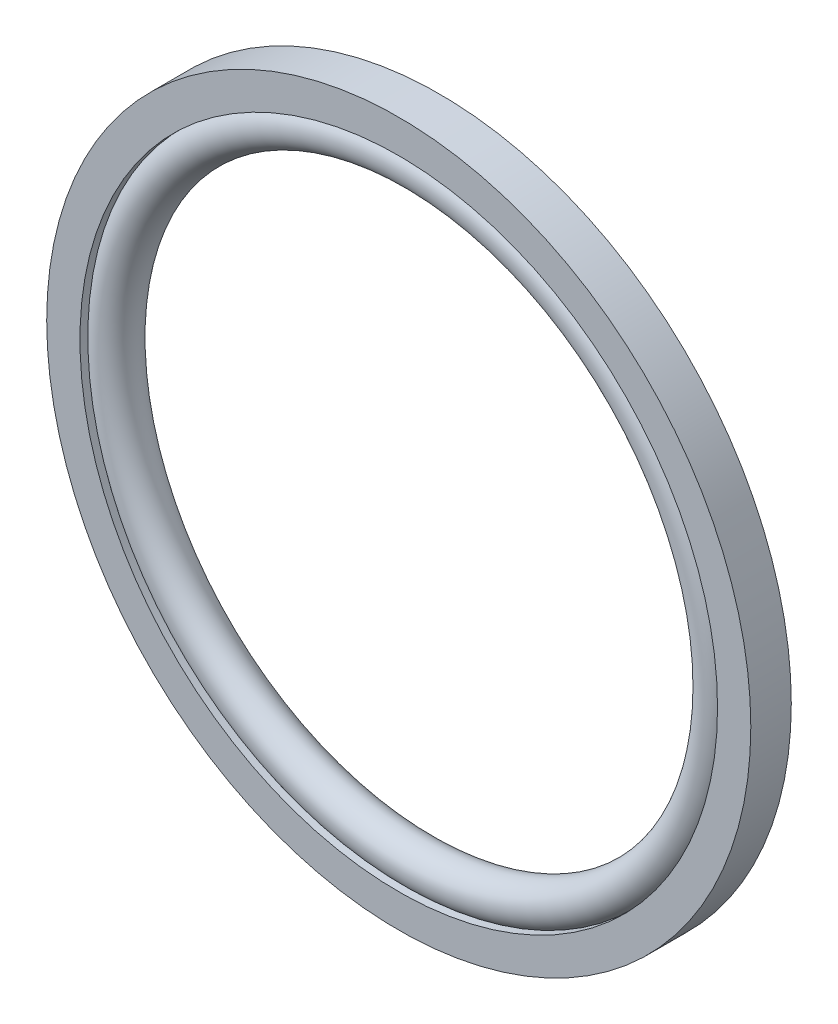
ISO-10303-21;
HEADER;
FILE_DESCRIPTION(('STEP AP214'),'2;1');
FILE_NAME('part.step','',(''),(''),'','','');
FILE_SCHEMA(('AUTOMOTIVE_DESIGN { 1 0 10303 214 1 1 1 1 }'));
ENDSEC;
DATA;
#1=APPLICATION_CONTEXT('core data for automotive mechanical design processes');
#2=APPLICATION_PROTOCOL_DEFINITION('international standard','automotive_design',2000,#1);
#3=PRODUCT_CONTEXT('',#1,'mechanical');
#4=PRODUCT('Part','Part','',(#3));
#5=PRODUCT_RELATED_PRODUCT_CATEGORY('part','',(#4));
#6=PRODUCT_DEFINITION_FORMATION('','',#4);
#7=PRODUCT_DEFINITION_CONTEXT('part definition',#1,'design');
#8=PRODUCT_DEFINITION('design','',#6,#7);
#9=PRODUCT_DEFINITION_SHAPE('','',#8);
#10=(LENGTH_UNIT() NAMED_UNIT(*) SI_UNIT(.MILLI.,.METRE.));
#11=(NAMED_UNIT(*) PLANE_ANGLE_UNIT() SI_UNIT($,.RADIAN.));
#12=(NAMED_UNIT(*) SI_UNIT($,.STERADIAN.) SOLID_ANGLE_UNIT());
#13=UNCERTAINTY_MEASURE_WITH_UNIT(LENGTH_MEASURE(1.E-05),#10,'distance_accuracy_value','');
#14=(GEOMETRIC_REPRESENTATION_CONTEXT(3) GLOBAL_UNCERTAINTY_ASSIGNED_CONTEXT((#13)) GLOBAL_UNIT_ASSIGNED_CONTEXT((#10,
#11,#12)) REPRESENTATION_CONTEXT('',''));
#15=CARTESIAN_POINT('',(0.,0.,0.));
#16=DIRECTION('',(0.,0.,1.));
#17=DIRECTION('',(1.,0.,0.));
#18=AXIS2_PLACEMENT_3D('',#15,#16,#17);
#19=CARTESIAN_POINT('',(0.,0.,0.));
#20=DIRECTION('',(0.,0.,1.));
#21=DIRECTION('',(1.,0.,0.));
#22=AXIS2_PLACEMENT_3D('',#19,#20,#21);
#23=TOROIDAL_SURFACE('',#22,21.8313,1.4605);
#24=CARTESIAN_POINT('',(0.,0.,-0.876299999999997));
#25=DIRECTION('',(0.,0.,1.));
#26=DIRECTION('',(1.,0.,0.));
#27=AXIS2_PLACEMENT_3D('',#24,#25,#26);
#28=CIRCLE('',#27,22.9997);
#29=CARTESIAN_POINT('',(22.9997,0.,-0.876299999999997));
#30=VERTEX_POINT('',#29);
#31=EDGE_CURVE('E11',#30,#30,#28,.T.);
#32=ORIENTED_EDGE('',*,*,#31,.F.);
#33=EDGE_LOOP('',(#32));
#34=FACE_BOUND('',#33,.T.);
#35=CARTESIAN_POINT('',(0.,0.,0.876299999999997));
#36=DIRECTION('',(0.,0.,1.));
#37=DIRECTION('',(1.,0.,0.));
#38=AXIS2_PLACEMENT_3D('',#35,#36,#37);
#39=CIRCLE('',#38,22.9997);
#40=CARTESIAN_POINT('',(22.9997,0.,0.876299999999997));
#41=VERTEX_POINT('',#40);
#42=EDGE_CURVE('E48',#41,#41,#39,.T.);
#43=ORIENTED_EDGE('',*,*,#42,.T.);
#44=EDGE_LOOP('',(#43));
#45=FACE_BOUND('',#44,.T.);
#46=ADVANCED_FACE('F42',(#34,#45),#23,.T.);
#47=CARTESIAN_POINT('',(0.,0.,1.4605));
#48=DIRECTION('',(0.,0.,1.));
#49=DIRECTION('',(1.,0.,0.));
#50=AXIS2_PLACEMENT_3D('',#47,#48,#49);
#51=CYLINDRICAL_SURFACE('',#50,22.9997);
#52=ORIENTED_EDGE('',*,*,#42,.F.);
#53=EDGE_LOOP('',(#52));
#54=FACE_BOUND('',#53,.T.);
#55=ORIENTED_EDGE('',*,*,#31,.T.);
#56=EDGE_LOOP('',(#55));
#57=FACE_BOUND('',#56,.T.);
#58=ADVANCED_FACE('F55',(#54,#57),#51,.T.);
#59=CLOSED_SHELL('',(#46,#58));
#60=MANIFOLD_SOLID_BREP('B2',#59);
#61=CARTESIAN_POINT('',(0.,22.9997,-1.4605));
#62=DIRECTION('',(0.,0.,1.));
#63=DIRECTION('',(1.,0.,0.));
#64=AXIS2_PLACEMENT_3D('',#61,#62,#63);
#65=PLANE('',#64);
#66=CARTESIAN_POINT('',(0.,0.,-1.4605));
#67=DIRECTION('',(0.,0.,1.));
#68=DIRECTION('',(1.,0.,0.));
#69=AXIS2_PLACEMENT_3D('',#66,#67,#68);
#70=CIRCLE('',#69,25.4);
#71=CARTESIAN_POINT('',(25.4,0.,-1.4605));
#72=VERTEX_POINT('',#71);
#73=EDGE_CURVE('E41',#72,#72,#70,.T.);
#74=ORIENTED_EDGE('',*,*,#73,.F.);
#75=EDGE_LOOP('',(#74));
#76=FACE_BOUND('',#75,.T.);
#77=CARTESIAN_POINT('',(0.,0.,-1.4605));
#78=DIRECTION('',(0.,0.,1.));
#79=DIRECTION('',(1.,0.,0.));
#80=AXIS2_PLACEMENT_3D('',#77,#78,#79);
#81=CIRCLE('',#80,22.9997);
#82=CARTESIAN_POINT('',(22.9997,0.,-1.4605));
#83=VERTEX_POINT('',#82);
#84=EDGE_CURVE('E87',#83,#83,#81,.T.);
#85=ORIENTED_EDGE('',*,*,#84,.T.);
#86=EDGE_LOOP('',(#85));
#87=FACE_BOUND('',#86,.T.);
#88=ADVANCED_FACE('F73',(#76,#87),#65,.F.);
#89=CARTESIAN_POINT('',(0.,0.,1.4605));
#90=DIRECTION('',(0.,0.,1.));
#91=DIRECTION('',(1.,0.,0.));
#92=AXIS2_PLACEMENT_3D('',#89,#90,#91);
#93=CYLINDRICAL_SURFACE('',#92,25.4);
#94=CARTESIAN_POINT('',(0.,0.,1.4605));
#95=DIRECTION('',(0.,0.,1.));
#96=DIRECTION('',(1.,0.,0.));
#97=AXIS2_PLACEMENT_3D('',#94,#95,#96);
#98=CIRCLE('',#97,25.4);
#99=CARTESIAN_POINT('',(25.4,0.,1.4605));
#100=VERTEX_POINT('',#99);
#101=EDGE_CURVE('E79',#100,#100,#98,.T.);
#102=ORIENTED_EDGE('',*,*,#101,.F.);
#103=EDGE_LOOP('',(#102));
#104=FACE_BOUND('',#103,.T.);
#105=ORIENTED_EDGE('',*,*,#73,.T.);
#106=EDGE_LOOP('',(#105));
#107=FACE_BOUND('',#106,.T.);
#108=ADVANCED_FACE('F102',(#104,#107),#93,.T.);
#109=CARTESIAN_POINT('',(0.,22.9997,1.4605));
#110=DIRECTION('',(0.,0.,-1.));
#111=DIRECTION('',(-1.,0.,0.));
#112=AXIS2_PLACEMENT_3D('',#109,#110,#111);
#113=PLANE('',#112);
#114=CARTESIAN_POINT('',(0.,0.,1.4605));
#115=DIRECTION('',(0.,0.,1.));
#116=DIRECTION('',(1.,0.,0.));
#117=AXIS2_PLACEMENT_3D('',#114,#115,#116);
#118=CIRCLE('',#117,22.9997);
#119=CARTESIAN_POINT('',(22.9997,0.,1.4605));
#120=VERTEX_POINT('',#119);
#121=EDGE_CURVE('E83',#120,#120,#118,.T.);
#122=ORIENTED_EDGE('',*,*,#121,.F.);
#123=EDGE_LOOP('',(#122));
#124=FACE_BOUND('',#123,.T.);
#125=ORIENTED_EDGE('',*,*,#101,.T.);
#126=EDGE_LOOP('',(#125));
#127=FACE_BOUND('',#126,.T.);
#128=ADVANCED_FACE('F97',(#124,#127),#113,.F.);
#129=CARTESIAN_POINT('',(0.,0.,1.4605));
#130=DIRECTION('',(0.,0.,1.));
#131=DIRECTION('',(1.,0.,0.));
#132=AXIS2_PLACEMENT_3D('',#129,#130,#131);
#133=CYLINDRICAL_SURFACE('',#132,22.9997);
#134=ORIENTED_EDGE('',*,*,#84,.F.);
#135=EDGE_LOOP('',(#134));
#136=FACE_BOUND('',#135,.T.);
#137=ORIENTED_EDGE('',*,*,#121,.T.);
#138=EDGE_LOOP('',(#137));
#139=FACE_BOUND('',#138,.T.);
#140=ADVANCED_FACE('F94',(#136,#139),#133,.F.);
#141=CLOSED_SHELL('',(#88,#108,#128,#140));
#142=MANIFOLD_SOLID_BREP('B6',#141);
#143=ADVANCED_BREP_SHAPE_REPRESENTATION('',(#18,#60,#142),#14);
#144=SHAPE_DEFINITION_REPRESENTATION(#9,#143);
ENDSEC;
END-ISO-10303-21;
